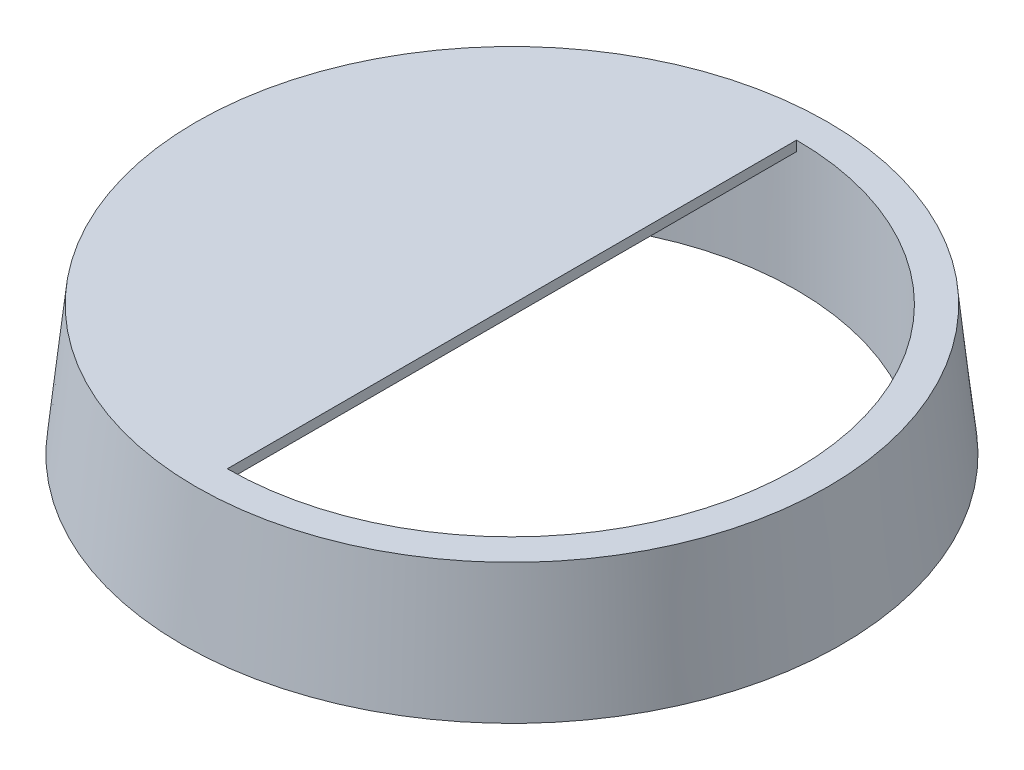
ISO-10303-21;
HEADER;
FILE_DESCRIPTION(('STEP AP214'),'2;1');
FILE_NAME('part.step','',(''),(''),'','','');
FILE_SCHEMA(('AUTOMOTIVE_DESIGN { 1 0 10303 214 1 1 1 1 }'));
ENDSEC;
DATA;
#1=APPLICATION_CONTEXT('core data for automotive mechanical design processes');
#2=APPLICATION_PROTOCOL_DEFINITION('international standard','automotive_design',2000,#1);
#3=PRODUCT_CONTEXT('',#1,'mechanical');
#4=PRODUCT('Part','Part','',(#3));
#5=PRODUCT_RELATED_PRODUCT_CATEGORY('part','',(#4));
#6=PRODUCT_DEFINITION_FORMATION('','',#4);
#7=PRODUCT_DEFINITION_CONTEXT('part definition',#1,'design');
#8=PRODUCT_DEFINITION('design','',#6,#7);
#9=PRODUCT_DEFINITION_SHAPE('','',#8);
#10=(LENGTH_UNIT() NAMED_UNIT(*) SI_UNIT(.MILLI.,.METRE.));
#11=(NAMED_UNIT(*) PLANE_ANGLE_UNIT() SI_UNIT($,.RADIAN.));
#12=(NAMED_UNIT(*) SI_UNIT($,.STERADIAN.) SOLID_ANGLE_UNIT());
#13=UNCERTAINTY_MEASURE_WITH_UNIT(LENGTH_MEASURE(1.E-05),#10,'distance_accuracy_value','');
#14=(GEOMETRIC_REPRESENTATION_CONTEXT(3) GLOBAL_UNCERTAINTY_ASSIGNED_CONTEXT((#13)) GLOBAL_UNIT_ASSIGNED_CONTEXT((#10,
#11,#12)) REPRESENTATION_CONTEXT('',''));
#15=CARTESIAN_POINT('',(0.,0.,0.));
#16=DIRECTION('',(0.,0.,1.));
#17=DIRECTION('',(1.,0.,0.));
#18=AXIS2_PLACEMENT_3D('',#15,#16,#17);
#19=CARTESIAN_POINT('',(0.,0.,0.));
#20=DIRECTION('',(0.,-1.,0.));
#21=DIRECTION('',(0.,0.,1.));
#22=AXIS2_PLACEMENT_3D('',#19,#20,#21);
#23=CONICAL_SURFACE('',#22,16.5,0.10471975511966);
#24=CARTESIAN_POINT('',(0.,6.5,0.));
#25=DIRECTION('',(0.,1.,0.));
#26=DIRECTION('',(0.,0.,1.));
#27=AXIS2_PLACEMENT_3D('',#24,#25,#26);
#28=CIRCLE('',#27,15.8168224707731);
#29=CARTESIAN_POINT('',(0.,6.5,15.8168224707731));
#30=VERTEX_POINT('',#29);
#31=EDGE_CURVE('E109',#30,#30,#28,.T.);
#32=ORIENTED_EDGE('',*,*,#31,.F.);
#33=EDGE_LOOP('',(#32));
#34=FACE_BOUND('',#33,.T.);
#35=CARTESIAN_POINT('',(0.,0.,0.));
#36=DIRECTION('',(0.,1.,0.));
#37=DIRECTION('',(0.,0.,1.));
#38=AXIS2_PLACEMENT_3D('',#35,#36,#37);
#39=CIRCLE('',#38,16.5);
#40=CARTESIAN_POINT('',(0.,0.,16.5));
#41=VERTEX_POINT('',#40);
#42=EDGE_CURVE('E102',#41,#41,#39,.T.);
#43=ORIENTED_EDGE('',*,*,#42,.T.);
#44=EDGE_LOOP('',(#43));
#45=FACE_BOUND('',#44,.T.);
#46=ADVANCED_FACE('F39',(#34,#45),#23,.T.);
#47=CARTESIAN_POINT('',(0.,6.5,0.));
#48=DIRECTION('',(0.,1.,0.));
#49=DIRECTION('',(0.,0.,1.));
#50=AXIS2_PLACEMENT_3D('',#47,#48,#49);
#51=PLANE('',#50);
#52=CARTESIAN_POINT('',(0.,6.5,0.));
#53=DIRECTION('',(0.,1.,0.));
#54=DIRECTION('',(0.,0.,1.));
#55=AXIS2_PLACEMENT_3D('',#52,#53,#54);
#56=CIRCLE('',#55,14.25);
#57=CARTESIAN_POINT('',(0.,6.5,14.25));
#58=VERTEX_POINT('',#57);
#59=CARTESIAN_POINT('',(0.,6.5,-14.25));
#60=VERTEX_POINT('',#59);
#61=EDGE_CURVE('E77',#58,#60,#56,.T.);
#62=ORIENTED_EDGE('',*,*,#61,.F.);
#63=DIRECTION('',(0.,0.,1.));
#64=VECTOR('',#63,1.);
#65=CARTESIAN_POINT('',(0.,6.5,14.25));
#66=LINE('',#65,#64);
#67=EDGE_CURVE('E87',#60,#58,#66,.T.);
#68=ORIENTED_EDGE('',*,*,#67,.F.);
#69=EDGE_LOOP('',(#62,#68));
#70=FACE_BOUND('',#69,.T.);
#71=ORIENTED_EDGE('',*,*,#31,.T.);
#72=EDGE_LOOP('',(#71));
#73=FACE_BOUND('',#72,.T.);
#74=ADVANCED_FACE('F92',(#70,#73),#51,.T.);
#75=CARTESIAN_POINT('',(0.,0.,0.));
#76=DIRECTION('',(0.,1.,0.));
#77=DIRECTION('',(0.,0.,1.));
#78=AXIS2_PLACEMENT_3D('',#75,#76,#77);
#79=PLANE('',#78);
#80=CARTESIAN_POINT('',(0.,0.,0.));
#81=DIRECTION('',(0.,-1.,0.));
#82=DIRECTION('',(0.,0.,-1.));
#83=AXIS2_PLACEMENT_3D('',#80,#81,#82);
#84=CIRCLE('',#83,14.25);
#85=CARTESIAN_POINT('',(0.,0.,-14.25));
#86=VERTEX_POINT('',#85);
#87=EDGE_CURVE('E84',#86,#86,#84,.T.);
#88=ORIENTED_EDGE('',*,*,#87,.F.);
#89=EDGE_LOOP('',(#88));
#90=FACE_BOUND('',#89,.T.);
#91=ORIENTED_EDGE('',*,*,#42,.F.);
#92=EDGE_LOOP('',(#91));
#93=FACE_BOUND('',#92,.T.);
#94=ADVANCED_FACE('F130',(#90,#93),#79,.F.);
#95=CARTESIAN_POINT('',(0.,4.5,0.));
#96=DIRECTION('',(0.,-1.,0.));
#97=DIRECTION('',(0.,0.,-1.));
#98=AXIS2_PLACEMENT_3D('',#95,#96,#97);
#99=CYLINDRICAL_SURFACE('',#98,14.25);
#100=DIRECTION('',(0.,1.,0.));
#101=VECTOR('',#100,1.);
#102=CARTESIAN_POINT('',(0.,0.5,-14.25));
#103=LINE('',#102,#101);
#104=CARTESIAN_POINT('',(0.,6.00000000000001,-14.25));
#105=VERTEX_POINT('',#104);
#106=EDGE_CURVE('E85',#105,#60,#103,.T.);
#107=ORIENTED_EDGE('',*,*,#106,.F.);
#108=CARTESIAN_POINT('',(0.,6.00000000000001,0.));
#109=DIRECTION('',(0.707106781186546,-0.707106781186549,0.));
#110=DIRECTION('',(-0.707106781186549,-0.707106781186546,0.));
#111=AXIS2_PLACEMENT_3D('',#108,#109,#110);
#112=ELLIPSE('',#111,20.1525432638166,14.25);
#113=CARTESIAN_POINT('',(-1.50000000000002,4.5,-14.1708327207684));
#114=VERTEX_POINT('',#113);
#115=EDGE_CURVE('E48',#105,#114,#112,.F.);
#116=ORIENTED_EDGE('',*,*,#115,.T.);
#117=CARTESIAN_POINT('',(0.,4.5,0.));
#118=DIRECTION('',(0.,-1.,0.));
#119=DIRECTION('',(0.,0.,-1.));
#120=AXIS2_PLACEMENT_3D('',#117,#118,#119);
#121=CIRCLE('',#120,14.25);
#122=CARTESIAN_POINT('',(-1.50000000000002,4.5,14.1708327207684));
#123=VERTEX_POINT('',#122);
#124=EDGE_CURVE('E99',#123,#114,#121,.T.);
#125=ORIENTED_EDGE('',*,*,#124,.F.);
#126=CARTESIAN_POINT('',(0.,6.00000000000001,0.));
#127=DIRECTION('',(0.707106781186546,-0.707106781186549,0.));
#128=DIRECTION('',(-0.707106781186549,-0.707106781186546,0.));
#129=AXIS2_PLACEMENT_3D('',#126,#127,#128);
#130=ELLIPSE('',#129,20.1525432638166,14.25);
#131=CARTESIAN_POINT('',(0.,6.00000000000001,14.25));
#132=VERTEX_POINT('',#131);
#133=EDGE_CURVE('E11',#123,#132,#130,.F.);
#134=ORIENTED_EDGE('',*,*,#133,.T.);
#135=DIRECTION('',(0.,1.,0.));
#136=VECTOR('',#135,1.);
#137=CARTESIAN_POINT('',(0.,0.5,14.25));
#138=LINE('',#137,#136);
#139=EDGE_CURVE('E72',#132,#58,#138,.T.);
#140=ORIENTED_EDGE('',*,*,#139,.T.);
#141=ORIENTED_EDGE('',*,*,#61,.T.);
#142=EDGE_LOOP('',(#107,#116,#125,#134,#140,#141));
#143=FACE_BOUND('',#142,.T.);
#144=ORIENTED_EDGE('',*,*,#87,.T.);
#145=EDGE_LOOP('',(#144));
#146=FACE_BOUND('',#145,.T.);
#147=ADVANCED_FACE('F74',(#143,#146),#99,.F.);
#148=CARTESIAN_POINT('',(0.,4.5,0.));
#149=DIRECTION('',(0.,-1.,0.));
#150=DIRECTION('',(0.,0.,-1.));
#151=AXIS2_PLACEMENT_3D('',#148,#149,#150);
#152=PLANE('',#151);
#153=ORIENTED_EDGE('',*,*,#124,.T.);
#154=DIRECTION('',(0.,0.,1.));
#155=VECTOR('',#154,1.);
#156=CARTESIAN_POINT('',(-1.50000000000002,4.5,14.25));
#157=LINE('',#156,#155);
#158=EDGE_CURVE('E60',#114,#123,#157,.T.);
#159=ORIENTED_EDGE('',*,*,#158,.T.);
#160=EDGE_LOOP('',(#153,#159));
#161=FACE_BOUND('',#160,.T.);
#162=ADVANCED_FACE('F123',(#161),#152,.T.);
#163=CARTESIAN_POINT('',(0.,0.5,14.25));
#164=DIRECTION('',(-1.,0.,0.));
#165=DIRECTION('',(0.,0.,1.));
#166=AXIS2_PLACEMENT_3D('',#163,#164,#165);
#167=PLANE('',#166);
#168=ORIENTED_EDGE('',*,*,#139,.F.);
#169=DIRECTION('',(0.,0.,-1.));
#170=VECTOR('',#169,1.);
#171=CARTESIAN_POINT('',(0.,6.00000000000001,-14.25));
#172=LINE('',#171,#170);
#173=EDGE_CURVE('E113',#132,#105,#172,.T.);
#174=ORIENTED_EDGE('',*,*,#173,.T.);
#175=ORIENTED_EDGE('',*,*,#106,.T.);
#176=ORIENTED_EDGE('',*,*,#67,.T.);
#177=EDGE_LOOP('',(#168,#174,#175,#176));
#178=FACE_BOUND('',#177,.T.);
#179=ADVANCED_FACE('F88',(#178),#167,.F.);
#180=CARTESIAN_POINT('',(0.,6.00000000000001,14.25));
#181=DIRECTION('',(0.707106781186546,-0.707106781186549,0.));
#182=DIRECTION('',(0.,0.,1.));
#183=AXIS2_PLACEMENT_3D('',#180,#181,#182);
#184=PLANE('',#183);
#185=ORIENTED_EDGE('',*,*,#133,.F.);
#186=ORIENTED_EDGE('',*,*,#158,.F.);
#187=ORIENTED_EDGE('',*,*,#115,.F.);
#188=ORIENTED_EDGE('',*,*,#173,.F.);
#189=EDGE_LOOP('',(#185,#186,#187,#188));
#190=FACE_BOUND('',#189,.T.);
#191=ADVANCED_FACE('F41',(#190),#184,.T.);
#192=CLOSED_SHELL('',(#46,#74,#94,#147,#162,#179,#191));
#193=MANIFOLD_SOLID_BREP('B2',#192);
#194=ADVANCED_BREP_SHAPE_REPRESENTATION('',(#18,#193),#14);
#195=SHAPE_DEFINITION_REPRESENTATION(#9,#194);
ENDSEC;
END-ISO-10303-21;
